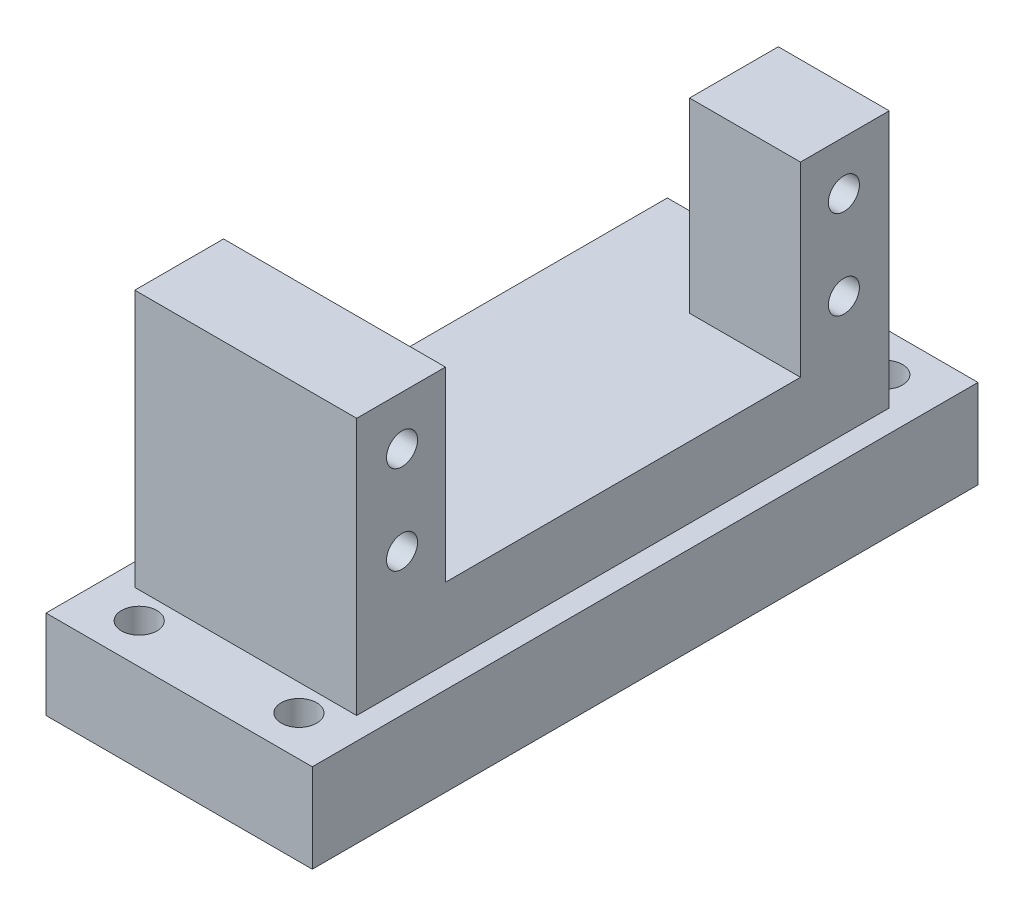
ISO-10303-21;
HEADER;
FILE_DESCRIPTION(('STEP AP214'),'2;1');
FILE_NAME('part.step','',(''),(''),'','','');
FILE_SCHEMA(('AUTOMOTIVE_DESIGN { 1 0 10303 214 1 1 1 1 }'));
ENDSEC;
DATA;
#1=APPLICATION_CONTEXT('core data for automotive mechanical design processes');
#2=APPLICATION_PROTOCOL_DEFINITION('international standard','automotive_design',2000,#1);
#3=PRODUCT_CONTEXT('',#1,'mechanical');
#4=PRODUCT('Part','Part','',(#3));
#5=PRODUCT_RELATED_PRODUCT_CATEGORY('part','',(#4));
#6=PRODUCT_DEFINITION_FORMATION('','',#4);
#7=PRODUCT_DEFINITION_CONTEXT('part definition',#1,'design');
#8=PRODUCT_DEFINITION('design','',#6,#7);
#9=PRODUCT_DEFINITION_SHAPE('','',#8);
#10=(LENGTH_UNIT() NAMED_UNIT(*) SI_UNIT(.MILLI.,.METRE.));
#11=(NAMED_UNIT(*) PLANE_ANGLE_UNIT() SI_UNIT($,.RADIAN.));
#12=(NAMED_UNIT(*) SI_UNIT($,.STERADIAN.) SOLID_ANGLE_UNIT());
#13=UNCERTAINTY_MEASURE_WITH_UNIT(LENGTH_MEASURE(1.E-05),#10,'distance_accuracy_value','');
#14=(GEOMETRIC_REPRESENTATION_CONTEXT(3) GLOBAL_UNCERTAINTY_ASSIGNED_CONTEXT((#13)) GLOBAL_UNIT_ASSIGNED_CONTEXT((#10,
#11,#12)) REPRESENTATION_CONTEXT('',''));
#15=CARTESIAN_POINT('',(0.,0.,0.));
#16=DIRECTION('',(0.,0.,1.));
#17=DIRECTION('',(1.,0.,0.));
#18=AXIS2_PLACEMENT_3D('',#15,#16,#17);
#19=CARTESIAN_POINT('',(0.,8.,0.));
#20=DIRECTION('',(0.,-1.,0.));
#21=DIRECTION('',(0.,0.,-1.));
#22=AXIS2_PLACEMENT_3D('',#19,#20,#21);
#23=PLANE('',#22);
#24=DIRECTION('',(1.,0.,0.));
#25=VECTOR('',#24,1.);
#26=CARTESIAN_POINT('',(0.,8.,-20.));
#27=LINE('',#26,#25);
#28=CARTESIAN_POINT('',(0.,8.,-20.));
#29=VERTEX_POINT('',#28);
#30=CARTESIAN_POINT('',(12.5,8.,-20.));
#31=VERTEX_POINT('',#30);
#32=EDGE_CURVE('E50',#29,#31,#27,.T.);
#33=ORIENTED_EDGE('',*,*,#32,.F.);
#34=DIRECTION('',(0.,0.,1.));
#35=VECTOR('',#34,1.);
#36=CARTESIAN_POINT('',(0.,8.,-30.));
#37=LINE('',#36,#35);
#38=CARTESIAN_POINT('',(0.,8.,-30.));
#39=VERTEX_POINT('',#38);
#40=EDGE_CURVE('E188',#39,#29,#37,.T.);
#41=ORIENTED_EDGE('',*,*,#40,.F.);
#42=DIRECTION('',(-1.,0.,0.));
#43=VECTOR('',#42,1.);
#44=CARTESIAN_POINT('',(-12.5,8.,-30.));
#45=LINE('',#44,#43);
#46=CARTESIAN_POINT('',(-12.5,8.,-30.));
#47=VERTEX_POINT('',#46);
#48=EDGE_CURVE('E258',#39,#47,#45,.T.);
#49=ORIENTED_EDGE('',*,*,#48,.T.);
#50=DIRECTION('',(0.,0.,1.));
#51=VECTOR('',#50,1.);
#52=CARTESIAN_POINT('',(-12.5,8.,30.));
#53=LINE('',#52,#51);
#54=CARTESIAN_POINT('',(-12.5,8.,20.));
#55=VERTEX_POINT('',#54);
#56=EDGE_CURVE('E225',#47,#55,#53,.T.);
#57=ORIENTED_EDGE('',*,*,#56,.T.);
#58=DIRECTION('',(-1.,0.,0.));
#59=VECTOR('',#58,1.);
#60=CARTESIAN_POINT('',(-12.5,8.,20.));
#61=LINE('',#60,#59);
#62=CARTESIAN_POINT('',(12.5,8.,20.));
#63=VERTEX_POINT('',#62);
#64=EDGE_CURVE('E205',#63,#55,#61,.T.);
#65=ORIENTED_EDGE('',*,*,#64,.F.);
#66=DIRECTION('',(0.,0.,-1.));
#67=VECTOR('',#66,1.);
#68=CARTESIAN_POINT('',(12.5,8.,30.));
#69=LINE('',#68,#67);
#70=EDGE_CURVE('E55',#63,#31,#69,.T.);
#71=ORIENTED_EDGE('',*,*,#70,.T.);
#72=EDGE_LOOP('',(#33,#41,#49,#57,#65,#71));
#73=FACE_BOUND('',#72,.T.);
#74=ADVANCED_FACE('F33',(#73),#23,.F.);
#75=CARTESIAN_POINT('',(12.5,8.,30.));
#76=DIRECTION('',(-1.,0.,0.));
#77=DIRECTION('',(0.,0.,1.));
#78=AXIS2_PLACEMENT_3D('',#75,#76,#77);
#79=PLANE('',#78);
#80=CARTESIAN_POINT('',(12.5,13.47,24.89));
#81=DIRECTION('',(-1.,0.,0.));
#82=DIRECTION('',(0.,0.,1.));
#83=AXIS2_PLACEMENT_3D('',#80,#81,#82);
#84=CIRCLE('',#83,1.75);
#85=CARTESIAN_POINT('',(12.5,13.47,26.64));
#86=VERTEX_POINT('',#85);
#87=EDGE_CURVE('E158',#86,#86,#84,.T.);
#88=ORIENTED_EDGE('',*,*,#87,.T.);
#89=EDGE_LOOP('',(#88));
#90=FACE_BOUND('',#89,.T.);
#91=CARTESIAN_POINT('',(12.5,23.47,24.89));
#92=DIRECTION('',(-1.,0.,0.));
#93=DIRECTION('',(0.,0.,1.));
#94=AXIS2_PLACEMENT_3D('',#91,#92,#93);
#95=CIRCLE('',#94,1.75);
#96=CARTESIAN_POINT('',(12.5,23.47,26.64));
#97=VERTEX_POINT('',#96);
#98=EDGE_CURVE('E167',#97,#97,#95,.T.);
#99=ORIENTED_EDGE('',*,*,#98,.T.);
#100=EDGE_LOOP('',(#99));
#101=FACE_BOUND('',#100,.T.);
#102=CARTESIAN_POINT('',(12.5,13.47,-24.89));
#103=DIRECTION('',(-1.,0.,0.));
#104=DIRECTION('',(0.,0.,1.));
#105=AXIS2_PLACEMENT_3D('',#102,#103,#104);
#106=CIRCLE('',#105,1.75);
#107=CARTESIAN_POINT('',(12.5,13.47,-23.14));
#108=VERTEX_POINT('',#107);
#109=EDGE_CURVE('E173',#108,#108,#106,.T.);
#110=ORIENTED_EDGE('',*,*,#109,.T.);
#111=EDGE_LOOP('',(#110));
#112=FACE_BOUND('',#111,.T.);
#113=CARTESIAN_POINT('',(12.5,23.47,-24.89));
#114=DIRECTION('',(-1.,0.,0.));
#115=DIRECTION('',(0.,0.,1.));
#116=AXIS2_PLACEMENT_3D('',#113,#114,#115);
#117=CIRCLE('',#116,1.75);
#118=CARTESIAN_POINT('',(12.5,23.47,-23.14));
#119=VERTEX_POINT('',#118);
#120=EDGE_CURVE('E179',#119,#119,#117,.T.);
#121=ORIENTED_EDGE('',*,*,#120,.T.);
#122=EDGE_LOOP('',(#121));
#123=FACE_BOUND('',#122,.T.);
#124=DIRECTION('',(0.,0.,-1.));
#125=VECTOR('',#124,1.);
#126=CARTESIAN_POINT('',(12.5,0.,30.));
#127=LINE('',#126,#125);
#128=CARTESIAN_POINT('',(12.5,0.,30.));
#129=VERTEX_POINT('',#128);
#130=CARTESIAN_POINT('',(12.5,0.,-30.));
#131=VERTEX_POINT('',#130);
#132=EDGE_CURVE('E233',#129,#131,#127,.T.);
#133=ORIENTED_EDGE('',*,*,#132,.T.);
#134=DIRECTION('',(0.,-1.,0.));
#135=VECTOR('',#134,1.);
#136=CARTESIAN_POINT('',(12.5,8.,-30.));
#137=LINE('',#136,#135);
#138=CARTESIAN_POINT('',(12.5,29.,-30.));
#139=VERTEX_POINT('',#138);
#140=EDGE_CURVE('E11',#139,#131,#137,.T.);
#141=ORIENTED_EDGE('',*,*,#140,.F.);
#142=DIRECTION('',(0.,0.,-1.));
#143=VECTOR('',#142,1.);
#144=CARTESIAN_POINT('',(12.5,29.,-20.));
#145=LINE('',#144,#143);
#146=CARTESIAN_POINT('',(12.5,29.,-20.));
#147=VERTEX_POINT('',#146);
#148=EDGE_CURVE('E187',#147,#139,#145,.T.);
#149=ORIENTED_EDGE('',*,*,#148,.F.);
#150=DIRECTION('',(0.,-1.,0.));
#151=VECTOR('',#150,1.);
#152=CARTESIAN_POINT('',(12.5,29.,-20.));
#153=LINE('',#152,#151);
#154=EDGE_CURVE('E203',#147,#31,#153,.T.);
#155=ORIENTED_EDGE('',*,*,#154,.T.);
#156=ORIENTED_EDGE('',*,*,#70,.F.);
#157=DIRECTION('',(0.,-1.,0.));
#158=VECTOR('',#157,1.);
#159=CARTESIAN_POINT('',(12.5,29.,20.));
#160=LINE('',#159,#158);
#161=CARTESIAN_POINT('',(12.5,29.,20.));
#162=VERTEX_POINT('',#161);
#163=EDGE_CURVE('E230',#162,#63,#160,.T.);
#164=ORIENTED_EDGE('',*,*,#163,.F.);
#165=DIRECTION('',(0.,0.,-1.));
#166=VECTOR('',#165,1.);
#167=CARTESIAN_POINT('',(12.5,29.,30.));
#168=LINE('',#167,#166);
#169=CARTESIAN_POINT('',(12.5,29.,30.));
#170=VERTEX_POINT('',#169);
#171=EDGE_CURVE('E212',#170,#162,#168,.T.);
#172=ORIENTED_EDGE('',*,*,#171,.F.);
#173=DIRECTION('',(0.,-1.,0.));
#174=VECTOR('',#173,1.);
#175=CARTESIAN_POINT('',(12.5,8.,30.));
#176=LINE('',#175,#174);
#177=EDGE_CURVE('E252',#170,#129,#176,.T.);
#178=ORIENTED_EDGE('',*,*,#177,.T.);
#179=EDGE_LOOP('',(#133,#141,#149,#155,#156,#164,#172,#178));
#180=FACE_BOUND('',#179,.T.);
#181=ADVANCED_FACE('F35',(#90,#101,#112,#123,#180),#79,.F.);
#182=CARTESIAN_POINT('',(-12.5,8.,-30.));
#183=DIRECTION('',(0.,0.,1.));
#184=DIRECTION('',(1.,0.,0.));
#185=AXIS2_PLACEMENT_3D('',#182,#183,#184);
#186=PLANE('',#185);
#187=DIRECTION('',(-1.,0.,0.));
#188=VECTOR('',#187,1.);
#189=CARTESIAN_POINT('',(-12.5,0.,-30.));
#190=LINE('',#189,#188);
#191=CARTESIAN_POINT('',(-12.5,0.,-30.));
#192=VERTEX_POINT('',#191);
#193=EDGE_CURVE('E238',#131,#192,#190,.T.);
#194=ORIENTED_EDGE('',*,*,#193,.T.);
#195=DIRECTION('',(0.,-1.,0.));
#196=VECTOR('',#195,1.);
#197=CARTESIAN_POINT('',(-12.5,8.,-30.));
#198=LINE('',#197,#196);
#199=EDGE_CURVE('E42',#47,#192,#198,.T.);
#200=ORIENTED_EDGE('',*,*,#199,.F.);
#201=ORIENTED_EDGE('',*,*,#48,.F.);
#202=DIRECTION('',(0.,-1.,0.));
#203=VECTOR('',#202,1.);
#204=CARTESIAN_POINT('',(0.,29.,-30.));
#205=LINE('',#204,#203);
#206=CARTESIAN_POINT('',(0.,29.,-30.));
#207=VERTEX_POINT('',#206);
#208=EDGE_CURVE('E200',#207,#39,#205,.T.);
#209=ORIENTED_EDGE('',*,*,#208,.F.);
#210=DIRECTION('',(-1.,0.,0.));
#211=VECTOR('',#210,1.);
#212=CARTESIAN_POINT('',(12.5,29.,-30.));
#213=LINE('',#212,#211);
#214=EDGE_CURVE('E191',#139,#207,#213,.T.);
#215=ORIENTED_EDGE('',*,*,#214,.F.);
#216=ORIENTED_EDGE('',*,*,#140,.T.);
#217=EDGE_LOOP('',(#194,#200,#201,#209,#215,#216));
#218=FACE_BOUND('',#217,.T.);
#219=ADVANCED_FACE('F281',(#218),#186,.F.);
#220=CARTESIAN_POINT('',(-12.5,8.,30.));
#221=DIRECTION('',(1.,0.,0.));
#222=DIRECTION('',(0.,0.,-1.));
#223=AXIS2_PLACEMENT_3D('',#220,#221,#222);
#224=PLANE('',#223);
#225=CARTESIAN_POINT('',(-12.5,13.47,24.89));
#226=DIRECTION('',(1.,0.,0.));
#227=DIRECTION('',(0.,0.,-1.));
#228=AXIS2_PLACEMENT_3D('',#225,#226,#227);
#229=CIRCLE('',#228,1.75);
#230=CARTESIAN_POINT('',(-12.5,13.47,23.14));
#231=VERTEX_POINT('',#230);
#232=EDGE_CURVE('E155',#231,#231,#229,.T.);
#233=ORIENTED_EDGE('',*,*,#232,.T.);
#234=EDGE_LOOP('',(#233));
#235=FACE_BOUND('',#234,.T.);
#236=CARTESIAN_POINT('',(-12.5,23.47,24.89));
#237=DIRECTION('',(1.,0.,0.));
#238=DIRECTION('',(0.,0.,-1.));
#239=AXIS2_PLACEMENT_3D('',#236,#237,#238);
#240=CIRCLE('',#239,1.75);
#241=CARTESIAN_POINT('',(-12.5,23.47,23.14));
#242=VERTEX_POINT('',#241);
#243=EDGE_CURVE('E165',#242,#242,#240,.T.);
#244=ORIENTED_EDGE('',*,*,#243,.T.);
#245=EDGE_LOOP('',(#244));
#246=FACE_BOUND('',#245,.T.);
#247=DIRECTION('',(0.,0.,1.));
#248=VECTOR('',#247,1.);
#249=CARTESIAN_POINT('',(-12.5,0.,30.));
#250=LINE('',#249,#248);
#251=CARTESIAN_POINT('',(-12.5,0.,30.));
#252=VERTEX_POINT('',#251);
#253=EDGE_CURVE('E243',#192,#252,#250,.T.);
#254=ORIENTED_EDGE('',*,*,#253,.T.);
#255=DIRECTION('',(0.,-1.,0.));
#256=VECTOR('',#255,1.);
#257=CARTESIAN_POINT('',(-12.5,8.,30.));
#258=LINE('',#257,#256);
#259=CARTESIAN_POINT('',(-12.5,29.,30.));
#260=VERTEX_POINT('',#259);
#261=EDGE_CURVE('E254',#260,#252,#258,.T.);
#262=ORIENTED_EDGE('',*,*,#261,.F.);
#263=DIRECTION('',(0.,0.,1.));
#264=VECTOR('',#263,1.);
#265=CARTESIAN_POINT('',(-12.5,29.,30.));
#266=LINE('',#265,#264);
#267=CARTESIAN_POINT('',(-12.5,29.,20.));
#268=VERTEX_POINT('',#267);
#269=EDGE_CURVE('E206',#268,#260,#266,.T.);
#270=ORIENTED_EDGE('',*,*,#269,.F.);
#271=DIRECTION('',(0.,-1.,0.));
#272=VECTOR('',#271,1.);
#273=CARTESIAN_POINT('',(-12.5,29.,20.));
#274=LINE('',#273,#272);
#275=EDGE_CURVE('E216',#268,#55,#274,.T.);
#276=ORIENTED_EDGE('',*,*,#275,.T.);
#277=ORIENTED_EDGE('',*,*,#56,.F.);
#278=ORIENTED_EDGE('',*,*,#199,.T.);
#279=EDGE_LOOP('',(#254,#262,#270,#276,#277,#278));
#280=FACE_BOUND('',#279,.T.);
#281=ADVANCED_FACE('F265',(#235,#246,#280),#224,.F.);
#282=CARTESIAN_POINT('',(-12.5,8.,30.));
#283=DIRECTION('',(0.,0.,-1.));
#284=DIRECTION('',(-1.,0.,0.));
#285=AXIS2_PLACEMENT_3D('',#282,#283,#284);
#286=PLANE('',#285);
#287=DIRECTION('',(1.,0.,0.));
#288=VECTOR('',#287,1.);
#289=CARTESIAN_POINT('',(-12.5,0.,30.));
#290=LINE('',#289,#288);
#291=EDGE_CURVE('E249',#252,#129,#290,.T.);
#292=ORIENTED_EDGE('',*,*,#291,.T.);
#293=ORIENTED_EDGE('',*,*,#177,.F.);
#294=DIRECTION('',(1.,0.,0.));
#295=VECTOR('',#294,1.);
#296=CARTESIAN_POINT('',(-12.5,29.,30.));
#297=LINE('',#296,#295);
#298=EDGE_CURVE('E209',#260,#170,#297,.T.);
#299=ORIENTED_EDGE('',*,*,#298,.F.);
#300=ORIENTED_EDGE('',*,*,#261,.T.);
#301=EDGE_LOOP('',(#292,#293,#299,#300));
#302=FACE_BOUND('',#301,.T.);
#303=ADVANCED_FACE('F284',(#302),#286,.F.);
#304=CARTESIAN_POINT('',(-12.5,29.,20.));
#305=DIRECTION('',(0.,0.,1.));
#306=DIRECTION('',(1.,0.,0.));
#307=AXIS2_PLACEMENT_3D('',#304,#305,#306);
#308=PLANE('',#307);
#309=ORIENTED_EDGE('',*,*,#64,.T.);
#310=ORIENTED_EDGE('',*,*,#275,.F.);
#311=DIRECTION('',(-1.,0.,0.));
#312=VECTOR('',#311,1.);
#313=CARTESIAN_POINT('',(-12.5,29.,20.));
#314=LINE('',#313,#312);
#315=EDGE_CURVE('E214',#162,#268,#314,.T.);
#316=ORIENTED_EDGE('',*,*,#315,.F.);
#317=ORIENTED_EDGE('',*,*,#163,.T.);
#318=EDGE_LOOP('',(#309,#310,#316,#317));
#319=FACE_BOUND('',#318,.T.);
#320=ADVANCED_FACE('F263',(#319),#308,.F.);
#321=CARTESIAN_POINT('',(0.,29.,0.));
#322=DIRECTION('',(0.,-1.,0.));
#323=DIRECTION('',(0.,0.,-1.));
#324=AXIS2_PLACEMENT_3D('',#321,#322,#323);
#325=PLANE('',#324);
#326=ORIENTED_EDGE('',*,*,#269,.T.);
#327=ORIENTED_EDGE('',*,*,#298,.T.);
#328=ORIENTED_EDGE('',*,*,#171,.T.);
#329=ORIENTED_EDGE('',*,*,#315,.T.);
#330=EDGE_LOOP('',(#326,#327,#328,#329));
#331=FACE_BOUND('',#330,.T.);
#332=ADVANCED_FACE('F268',(#331),#325,.F.);
#333=CARTESIAN_POINT('',(0.,29.,-20.));
#334=DIRECTION('',(0.,0.,-1.));
#335=DIRECTION('',(-1.,0.,0.));
#336=AXIS2_PLACEMENT_3D('',#333,#334,#335);
#337=PLANE('',#336);
#338=ORIENTED_EDGE('',*,*,#32,.T.);
#339=ORIENTED_EDGE('',*,*,#154,.F.);
#340=DIRECTION('',(1.,0.,0.));
#341=VECTOR('',#340,1.);
#342=CARTESIAN_POINT('',(0.,29.,-20.));
#343=LINE('',#342,#341);
#344=CARTESIAN_POINT('',(0.,29.,-20.));
#345=VERTEX_POINT('',#344);
#346=EDGE_CURVE('E184',#345,#147,#343,.T.);
#347=ORIENTED_EDGE('',*,*,#346,.F.);
#348=DIRECTION('',(0.,-1.,0.));
#349=VECTOR('',#348,1.);
#350=CARTESIAN_POINT('',(0.,29.,-20.));
#351=LINE('',#350,#349);
#352=EDGE_CURVE('E195',#345,#29,#351,.T.);
#353=ORIENTED_EDGE('',*,*,#352,.T.);
#354=EDGE_LOOP('',(#338,#339,#347,#353));
#355=FACE_BOUND('',#354,.T.);
#356=ADVANCED_FACE('F273',(#355),#337,.F.);
#357=CARTESIAN_POINT('',(0.,29.,-30.));
#358=DIRECTION('',(1.,0.,0.));
#359=DIRECTION('',(0.,0.,-1.));
#360=AXIS2_PLACEMENT_3D('',#357,#358,#359);
#361=PLANE('',#360);
#362=CARTESIAN_POINT('',(0.,13.47,-24.89));
#363=DIRECTION('',(1.,0.,0.));
#364=DIRECTION('',(0.,0.,-1.));
#365=AXIS2_PLACEMENT_3D('',#362,#363,#364);
#366=CIRCLE('',#365,1.75);
#367=CARTESIAN_POINT('',(0.,13.47,-26.64));
#368=VERTEX_POINT('',#367);
#369=EDGE_CURVE('E170',#368,#368,#366,.T.);
#370=ORIENTED_EDGE('',*,*,#369,.T.);
#371=EDGE_LOOP('',(#370));
#372=FACE_BOUND('',#371,.T.);
#373=CARTESIAN_POINT('',(0.,23.47,-24.89));
#374=DIRECTION('',(1.,0.,0.));
#375=DIRECTION('',(0.,0.,-1.));
#376=AXIS2_PLACEMENT_3D('',#373,#374,#375);
#377=CIRCLE('',#376,1.75);
#378=CARTESIAN_POINT('',(0.,23.47,-26.64));
#379=VERTEX_POINT('',#378);
#380=EDGE_CURVE('E176',#379,#379,#377,.T.);
#381=ORIENTED_EDGE('',*,*,#380,.T.);
#382=EDGE_LOOP('',(#381));
#383=FACE_BOUND('',#382,.T.);
#384=ORIENTED_EDGE('',*,*,#40,.T.);
#385=ORIENTED_EDGE('',*,*,#352,.F.);
#386=DIRECTION('',(0.,0.,1.));
#387=VECTOR('',#386,1.);
#388=CARTESIAN_POINT('',(0.,29.,-30.));
#389=LINE('',#388,#387);
#390=EDGE_CURVE('E193',#207,#345,#389,.T.);
#391=ORIENTED_EDGE('',*,*,#390,.F.);
#392=ORIENTED_EDGE('',*,*,#208,.T.);
#393=EDGE_LOOP('',(#384,#385,#391,#392));
#394=FACE_BOUND('',#393,.T.);
#395=ADVANCED_FACE('F277',(#372,#383,#394),#361,.F.);
#396=CARTESIAN_POINT('',(0.,29.,0.));
#397=DIRECTION('',(0.,1.,0.));
#398=DIRECTION('',(0.,0.,1.));
#399=AXIS2_PLACEMENT_3D('',#396,#397,#398);
#400=PLANE('',#399);
#401=ORIENTED_EDGE('',*,*,#346,.T.);
#402=ORIENTED_EDGE('',*,*,#148,.T.);
#403=ORIENTED_EDGE('',*,*,#214,.T.);
#404=ORIENTED_EDGE('',*,*,#390,.T.);
#405=EDGE_LOOP('',(#401,#402,#403,#404));
#406=FACE_BOUND('',#405,.T.);
#407=ADVANCED_FACE('F287',(#406),#400,.T.);
#408=CARTESIAN_POINT('',(-12.50105,23.47,-24.89));
#409=DIRECTION('',(1.,0.,0.));
#410=DIRECTION('',(0.,0.,-1.));
#411=AXIS2_PLACEMENT_3D('',#408,#409,#410);
#412=CYLINDRICAL_SURFACE('',#411,1.75);
#413=ORIENTED_EDGE('',*,*,#120,.F.);
#414=EDGE_LOOP('',(#413));
#415=FACE_BOUND('',#414,.T.);
#416=ORIENTED_EDGE('',*,*,#380,.F.);
#417=EDGE_LOOP('',(#416));
#418=FACE_BOUND('',#417,.T.);
#419=ADVANCED_FACE('F289',(#415,#418),#412,.F.);
#420=CARTESIAN_POINT('',(-12.50105,13.47,-24.89));
#421=DIRECTION('',(1.,0.,0.));
#422=DIRECTION('',(0.,0.,-1.));
#423=AXIS2_PLACEMENT_3D('',#420,#421,#422);
#424=CYLINDRICAL_SURFACE('',#423,1.75);
#425=ORIENTED_EDGE('',*,*,#109,.F.);
#426=EDGE_LOOP('',(#425));
#427=FACE_BOUND('',#426,.T.);
#428=ORIENTED_EDGE('',*,*,#369,.F.);
#429=EDGE_LOOP('',(#428));
#430=FACE_BOUND('',#429,.T.);
#431=ADVANCED_FACE('F295',(#427,#430),#424,.F.);
#432=CARTESIAN_POINT('',(-12.50105,23.47,24.89));
#433=DIRECTION('',(1.,0.,0.));
#434=DIRECTION('',(0.,0.,-1.));
#435=AXIS2_PLACEMENT_3D('',#432,#433,#434);
#436=CYLINDRICAL_SURFACE('',#435,1.75);
#437=ORIENTED_EDGE('',*,*,#98,.F.);
#438=EDGE_LOOP('',(#437));
#439=FACE_BOUND('',#438,.T.);
#440=ORIENTED_EDGE('',*,*,#243,.F.);
#441=EDGE_LOOP('',(#440));
#442=FACE_BOUND('',#441,.T.);
#443=ADVANCED_FACE('F364',(#439,#442),#436,.F.);
#444=CARTESIAN_POINT('',(-12.50105,13.47,24.89));
#445=DIRECTION('',(1.,0.,0.));
#446=DIRECTION('',(0.,0.,-1.));
#447=AXIS2_PLACEMENT_3D('',#444,#445,#446);
#448=CYLINDRICAL_SURFACE('',#447,1.75);
#449=ORIENTED_EDGE('',*,*,#87,.F.);
#450=EDGE_LOOP('',(#449));
#451=FACE_BOUND('',#450,.T.);
#452=ORIENTED_EDGE('',*,*,#232,.F.);
#453=EDGE_LOOP('',(#452));
#454=FACE_BOUND('',#453,.T.);
#455=ADVANCED_FACE('F374',(#451,#454),#448,.F.);
#456=CARTESIAN_POINT('',(0.,0.,0.));
#457=DIRECTION('',(0.,1.,0.));
#458=DIRECTION('',(0.,0.,1.));
#459=AXIS2_PLACEMENT_3D('',#456,#457,#458);
#460=PLANE('',#459);
#461=CARTESIAN_POINT('',(-8.99999999999931,0.,33.0000000000001));
#462=DIRECTION('',(0.,1.,0.));
#463=DIRECTION('',(0.,0.,1.));
#464=AXIS2_PLACEMENT_3D('',#461,#462,#463);
#465=CIRCLE('',#464,2.);
#466=CARTESIAN_POINT('',(-8.99999999999931,0.,35.0000000000001));
#467=VERTEX_POINT('',#466);
#468=EDGE_CURVE('E519',#467,#467,#465,.T.);
#469=ORIENTED_EDGE('',*,*,#468,.F.);
#470=EDGE_LOOP('',(#469));
#471=FACE_BOUND('',#470,.T.);
#472=CARTESIAN_POINT('',(9.00000000000069,0.,33.));
#473=DIRECTION('',(0.,1.,0.));
#474=DIRECTION('',(0.,0.,1.));
#475=AXIS2_PLACEMENT_3D('',#472,#473,#474);
#476=CIRCLE('',#475,2.);
#477=CARTESIAN_POINT('',(9.00000000000069,0.,35.));
#478=VERTEX_POINT('',#477);
#479=EDGE_CURVE('E523',#478,#478,#476,.T.);
#480=ORIENTED_EDGE('',*,*,#479,.F.);
#481=EDGE_LOOP('',(#480));
#482=FACE_BOUND('',#481,.T.);
#483=CARTESIAN_POINT('',(-9.00000000000001,0.,-32.9999999999999));
#484=DIRECTION('',(0.,1.,0.));
#485=DIRECTION('',(0.,0.,1.));
#486=AXIS2_PLACEMENT_3D('',#483,#484,#485);
#487=CIRCLE('',#486,2.);
#488=CARTESIAN_POINT('',(-9.00000000000001,0.,-30.9999999999999));
#489=VERTEX_POINT('',#488);
#490=EDGE_CURVE('E532',#489,#489,#487,.T.);
#491=ORIENTED_EDGE('',*,*,#490,.F.);
#492=EDGE_LOOP('',(#491));
#493=FACE_BOUND('',#492,.T.);
#494=CARTESIAN_POINT('',(8.99999999999999,0.,-33.));
#495=DIRECTION('',(0.,1.,0.));
#496=DIRECTION('',(0.,0.,1.));
#497=AXIS2_PLACEMENT_3D('',#494,#495,#496);
#498=CIRCLE('',#497,2.);
#499=CARTESIAN_POINT('',(8.99999999999999,0.,-31.));
#500=VERTEX_POINT('',#499);
#501=EDGE_CURVE('E538',#500,#500,#498,.T.);
#502=ORIENTED_EDGE('',*,*,#501,.F.);
#503=EDGE_LOOP('',(#502));
#504=FACE_BOUND('',#503,.T.);
#505=DIRECTION('',(0.,0.,-1.));
#506=VECTOR('',#505,1.);
#507=CARTESIAN_POINT('',(-15.,0.,37.5));
#508=LINE('',#507,#506);
#509=CARTESIAN_POINT('',(-15.,0.,37.5));
#510=VERTEX_POINT('',#509);
#511=CARTESIAN_POINT('',(-15.,0.,-37.5));
#512=VERTEX_POINT('',#511);
#513=EDGE_CURVE('E154',#510,#512,#508,.T.);
#514=ORIENTED_EDGE('',*,*,#513,.F.);
#515=DIRECTION('',(-1.,0.,0.));
#516=VECTOR('',#515,1.);
#517=CARTESIAN_POINT('',(15.,0.,37.5));
#518=LINE('',#517,#516);
#519=CARTESIAN_POINT('',(15.,0.,37.5));
#520=VERTEX_POINT('',#519);
#521=EDGE_CURVE('E150',#520,#510,#518,.T.);
#522=ORIENTED_EDGE('',*,*,#521,.F.);
#523=DIRECTION('',(0.,0.,1.));
#524=VECTOR('',#523,1.);
#525=CARTESIAN_POINT('',(15.,0.,37.5));
#526=LINE('',#525,#524);
#527=CARTESIAN_POINT('',(15.,0.,-37.5));
#528=VERTEX_POINT('',#527);
#529=EDGE_CURVE('E550',#528,#520,#526,.T.);
#530=ORIENTED_EDGE('',*,*,#529,.F.);
#531=DIRECTION('',(1.,0.,0.));
#532=VECTOR('',#531,1.);
#533=CARTESIAN_POINT('',(15.,0.,-37.5));
#534=LINE('',#533,#532);
#535=EDGE_CURVE('E548',#512,#528,#534,.T.);
#536=ORIENTED_EDGE('',*,*,#535,.F.);
#537=EDGE_LOOP('',(#514,#522,#530,#536));
#538=FACE_BOUND('',#537,.T.);
#539=ORIENTED_EDGE('',*,*,#132,.F.);
#540=ORIENTED_EDGE('',*,*,#291,.F.);
#541=ORIENTED_EDGE('',*,*,#253,.F.);
#542=ORIENTED_EDGE('',*,*,#193,.F.);
#543=EDGE_LOOP('',(#539,#540,#541,#542));
#544=FACE_BOUND('',#543,.T.);
#545=ADVANCED_FACE('F285',(#471,#482,#493,#504,#538,#544),#460,.T.);
#546=CARTESIAN_POINT('',(-15.,-10.,37.5));
#547=DIRECTION('',(1.,0.,0.));
#548=DIRECTION('',(0.,0.,-1.));
#549=AXIS2_PLACEMENT_3D('',#546,#547,#548);
#550=PLANE('',#549);
#551=ORIENTED_EDGE('',*,*,#513,.T.);
#552=DIRECTION('',(0.,1.,0.));
#553=VECTOR('',#552,1.);
#554=CARTESIAN_POINT('',(-15.,-10.,-37.5));
#555=LINE('',#554,#553);
#556=CARTESIAN_POINT('',(-15.,-10.,-37.5));
#557=VERTEX_POINT('',#556);
#558=EDGE_CURVE('E134',#557,#512,#555,.T.);
#559=ORIENTED_EDGE('',*,*,#558,.F.);
#560=DIRECTION('',(0.,0.,-1.));
#561=VECTOR('',#560,1.);
#562=CARTESIAN_POINT('',(-15.,-10.,37.5));
#563=LINE('',#562,#561);
#564=CARTESIAN_POINT('',(-15.,-10.,37.5));
#565=VERTEX_POINT('',#564);
#566=EDGE_CURVE('E141',#565,#557,#563,.T.);
#567=ORIENTED_EDGE('',*,*,#566,.F.);
#568=DIRECTION('',(0.,1.,0.));
#569=VECTOR('',#568,1.);
#570=CARTESIAN_POINT('',(-15.,-10.,37.5));
#571=LINE('',#570,#569);
#572=EDGE_CURVE('E546',#565,#510,#571,.T.);
#573=ORIENTED_EDGE('',*,*,#572,.T.);
#574=EDGE_LOOP('',(#551,#559,#567,#573));
#575=FACE_BOUND('',#574,.T.);
#576=ADVANCED_FACE('F152',(#575),#550,.F.);
#577=CARTESIAN_POINT('',(15.,-10.,-37.5));
#578=DIRECTION('',(0.,0.,1.));
#579=DIRECTION('',(1.,0.,0.));
#580=AXIS2_PLACEMENT_3D('',#577,#578,#579);
#581=PLANE('',#580);
#582=ORIENTED_EDGE('',*,*,#535,.T.);
#583=DIRECTION('',(0.,1.,0.));
#584=VECTOR('',#583,1.);
#585=CARTESIAN_POINT('',(15.,-10.,-37.5));
#586=LINE('',#585,#584);
#587=CARTESIAN_POINT('',(15.,-10.,-37.5));
#588=VERTEX_POINT('',#587);
#589=EDGE_CURVE('E137',#588,#528,#586,.T.);
#590=ORIENTED_EDGE('',*,*,#589,.F.);
#591=DIRECTION('',(1.,0.,0.));
#592=VECTOR('',#591,1.);
#593=CARTESIAN_POINT('',(15.,-10.,-37.5));
#594=LINE('',#593,#592);
#595=EDGE_CURVE('E130',#557,#588,#594,.T.);
#596=ORIENTED_EDGE('',*,*,#595,.F.);
#597=ORIENTED_EDGE('',*,*,#558,.T.);
#598=EDGE_LOOP('',(#582,#590,#596,#597));
#599=FACE_BOUND('',#598,.T.);
#600=ADVANCED_FACE('F132',(#599),#581,.F.);
#601=CARTESIAN_POINT('',(15.,-10.,37.5));
#602=DIRECTION('',(-1.,0.,0.));
#603=DIRECTION('',(0.,0.,1.));
#604=AXIS2_PLACEMENT_3D('',#601,#602,#603);
#605=PLANE('',#604);
#606=ORIENTED_EDGE('',*,*,#529,.T.);
#607=DIRECTION('',(0.,1.,0.));
#608=VECTOR('',#607,1.);
#609=CARTESIAN_POINT('',(15.,-10.,37.5));
#610=LINE('',#609,#608);
#611=CARTESIAN_POINT('',(15.,-10.,37.5));
#612=VERTEX_POINT('',#611);
#613=EDGE_CURVE('E160',#612,#520,#610,.T.);
#614=ORIENTED_EDGE('',*,*,#613,.F.);
#615=DIRECTION('',(0.,0.,1.));
#616=VECTOR('',#615,1.);
#617=CARTESIAN_POINT('',(15.,-10.,37.5));
#618=LINE('',#617,#616);
#619=EDGE_CURVE('E140',#588,#612,#618,.T.);
#620=ORIENTED_EDGE('',*,*,#619,.F.);
#621=ORIENTED_EDGE('',*,*,#589,.T.);
#622=EDGE_LOOP('',(#606,#614,#620,#621));
#623=FACE_BOUND('',#622,.T.);
#624=ADVANCED_FACE('F441',(#623),#605,.F.);
#625=CARTESIAN_POINT('',(15.,-10.,37.5));
#626=DIRECTION('',(0.,0.,-1.));
#627=DIRECTION('',(-1.,0.,0.));
#628=AXIS2_PLACEMENT_3D('',#625,#626,#627);
#629=PLANE('',#628);
#630=ORIENTED_EDGE('',*,*,#521,.T.);
#631=ORIENTED_EDGE('',*,*,#572,.F.);
#632=DIRECTION('',(-1.,0.,0.));
#633=VECTOR('',#632,1.);
#634=CARTESIAN_POINT('',(15.,-10.,37.5));
#635=LINE('',#634,#633);
#636=EDGE_CURVE('E146',#612,#565,#635,.T.);
#637=ORIENTED_EDGE('',*,*,#636,.F.);
#638=ORIENTED_EDGE('',*,*,#613,.T.);
#639=EDGE_LOOP('',(#630,#631,#637,#638));
#640=FACE_BOUND('',#639,.T.);
#641=ADVANCED_FACE('F448',(#640),#629,.F.);
#642=CARTESIAN_POINT('',(0.,-10.,0.));
#643=DIRECTION('',(0.,1.,0.));
#644=DIRECTION('',(0.,0.,1.));
#645=AXIS2_PLACEMENT_3D('',#642,#643,#644);
#646=PLANE('',#645);
#647=CARTESIAN_POINT('',(-8.99999999999931,-10.,33.0000000000001));
#648=DIRECTION('',(0.,1.,0.));
#649=DIRECTION('',(0.,0.,1.));
#650=AXIS2_PLACEMENT_3D('',#647,#648,#649);
#651=CIRCLE('',#650,2.);
#652=CARTESIAN_POINT('',(-8.99999999999931,-10.,35.0000000000001));
#653=VERTEX_POINT('',#652);
#654=EDGE_CURVE('E522',#653,#653,#651,.F.);
#655=ORIENTED_EDGE('',*,*,#654,.F.);
#656=EDGE_LOOP('',(#655));
#657=FACE_BOUND('',#656,.T.);
#658=CARTESIAN_POINT('',(9.00000000000069,-10.,33.));
#659=DIRECTION('',(0.,1.,0.));
#660=DIRECTION('',(0.,0.,1.));
#661=AXIS2_PLACEMENT_3D('',#658,#659,#660);
#662=CIRCLE('',#661,2.);
#663=CARTESIAN_POINT('',(9.00000000000069,-10.,35.));
#664=VERTEX_POINT('',#663);
#665=EDGE_CURVE('E526',#664,#664,#662,.F.);
#666=ORIENTED_EDGE('',*,*,#665,.F.);
#667=EDGE_LOOP('',(#666));
#668=FACE_BOUND('',#667,.T.);
#669=CARTESIAN_POINT('',(-9.00000000000001,-10.,-32.9999999999999));
#670=DIRECTION('',(0.,1.,0.));
#671=DIRECTION('',(0.,0.,1.));
#672=AXIS2_PLACEMENT_3D('',#669,#670,#671);
#673=CIRCLE('',#672,2.);
#674=CARTESIAN_POINT('',(-9.00000000000001,-10.,-30.9999999999999));
#675=VERTEX_POINT('',#674);
#676=EDGE_CURVE('E535',#675,#675,#673,.F.);
#677=ORIENTED_EDGE('',*,*,#676,.F.);
#678=EDGE_LOOP('',(#677));
#679=FACE_BOUND('',#678,.T.);
#680=CARTESIAN_POINT('',(8.99999999999999,-10.,-33.));
#681=DIRECTION('',(0.,1.,0.));
#682=DIRECTION('',(0.,0.,1.));
#683=AXIS2_PLACEMENT_3D('',#680,#681,#682);
#684=CIRCLE('',#683,2.);
#685=CARTESIAN_POINT('',(8.99999999999999,-10.,-31.));
#686=VERTEX_POINT('',#685);
#687=EDGE_CURVE('E541',#686,#686,#684,.F.);
#688=ORIENTED_EDGE('',*,*,#687,.F.);
#689=EDGE_LOOP('',(#688));
#690=FACE_BOUND('',#689,.T.);
#691=ORIENTED_EDGE('',*,*,#566,.T.);
#692=ORIENTED_EDGE('',*,*,#595,.T.);
#693=ORIENTED_EDGE('',*,*,#619,.T.);
#694=ORIENTED_EDGE('',*,*,#636,.T.);
#695=EDGE_LOOP('',(#691,#692,#693,#694));
#696=FACE_BOUND('',#695,.T.);
#697=ADVANCED_FACE('F144',(#657,#668,#679,#690,#696),#646,.F.);
#698=CARTESIAN_POINT('',(8.99999999999999,-10.001,-33.));
#699=DIRECTION('',(0.,1.,0.));
#700=DIRECTION('',(0.,0.,1.));
#701=AXIS2_PLACEMENT_3D('',#698,#699,#700);
#702=CYLINDRICAL_SURFACE('',#701,2.);
#703=ORIENTED_EDGE('',*,*,#501,.T.);
#704=EDGE_LOOP('',(#703));
#705=FACE_BOUND('',#704,.T.);
#706=ORIENTED_EDGE('',*,*,#687,.T.);
#707=EDGE_LOOP('',(#706));
#708=FACE_BOUND('',#707,.T.);
#709=ADVANCED_FACE('F461',(#705,#708),#702,.F.);
#710=CARTESIAN_POINT('',(-9.00000000000001,-10.001,-32.9999999999999));
#711=DIRECTION('',(0.,1.,0.));
#712=DIRECTION('',(0.,0.,1.));
#713=AXIS2_PLACEMENT_3D('',#710,#711,#712);
#714=CYLINDRICAL_SURFACE('',#713,2.);
#715=ORIENTED_EDGE('',*,*,#490,.T.);
#716=EDGE_LOOP('',(#715));
#717=FACE_BOUND('',#716,.T.);
#718=ORIENTED_EDGE('',*,*,#676,.T.);
#719=EDGE_LOOP('',(#718));
#720=FACE_BOUND('',#719,.T.);
#721=ADVANCED_FACE('F469',(#717,#720),#714,.F.);
#722=CARTESIAN_POINT('',(9.00000000000069,-10.001,33.));
#723=DIRECTION('',(0.,1.,0.));
#724=DIRECTION('',(0.,0.,1.));
#725=AXIS2_PLACEMENT_3D('',#722,#723,#724);
#726=CYLINDRICAL_SURFACE('',#725,2.);
#727=ORIENTED_EDGE('',*,*,#479,.T.);
#728=EDGE_LOOP('',(#727));
#729=FACE_BOUND('',#728,.T.);
#730=ORIENTED_EDGE('',*,*,#665,.T.);
#731=EDGE_LOOP('',(#730));
#732=FACE_BOUND('',#731,.T.);
#733=ADVANCED_FACE('F477',(#729,#732),#726,.F.);
#734=CARTESIAN_POINT('',(-8.99999999999931,-10.001,33.0000000000001));
#735=DIRECTION('',(0.,1.,0.));
#736=DIRECTION('',(0.,0.,1.));
#737=AXIS2_PLACEMENT_3D('',#734,#735,#736);
#738=CYLINDRICAL_SURFACE('',#737,2.);
#739=ORIENTED_EDGE('',*,*,#468,.T.);
#740=EDGE_LOOP('',(#739));
#741=FACE_BOUND('',#740,.T.);
#742=ORIENTED_EDGE('',*,*,#654,.T.);
#743=EDGE_LOOP('',(#742));
#744=FACE_BOUND('',#743,.T.);
#745=ADVANCED_FACE('F485',(#741,#744),#738,.F.);
#746=CLOSED_SHELL('',(#74,#181,#219,#281,#303,#320,#332,#356,#395,#407,#419,#431,#443,#455,#545,
#576,#600,#624,#641,#697,#709,#721,#733,#745));
#747=MANIFOLD_SOLID_BREP('B2',#746);
#748=ADVANCED_BREP_SHAPE_REPRESENTATION('',(#18,#747),#14);
#749=SHAPE_DEFINITION_REPRESENTATION(#9,#748);
ENDSEC;
END-ISO-10303-21;
